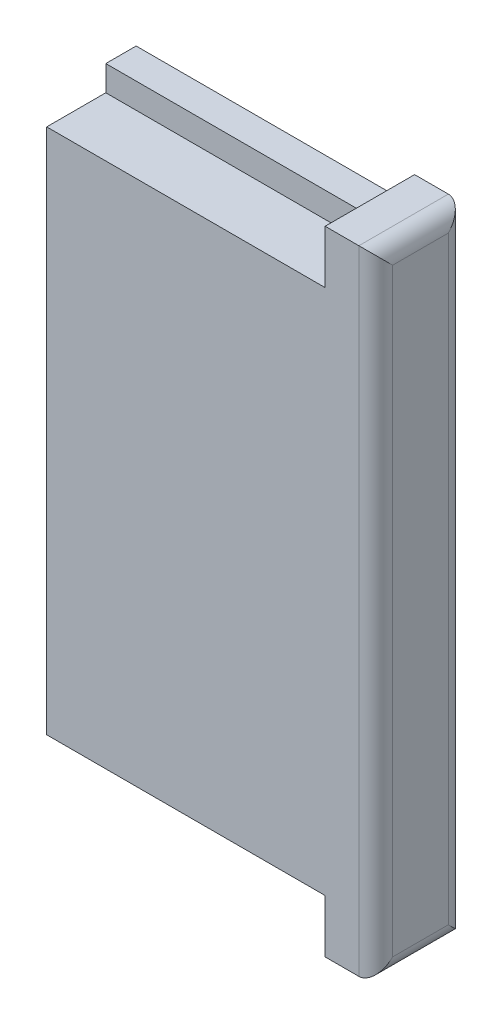
ISO-10303-21;
HEADER;
FILE_DESCRIPTION(('STEP AP214'),'2;1');
FILE_NAME('part.step','',(''),(''),'','','');
FILE_SCHEMA(('AUTOMOTIVE_DESIGN { 1 0 10303 214 1 1 1 1 }'));
ENDSEC;
DATA;
#1=APPLICATION_CONTEXT('core data for automotive mechanical design processes');
#2=APPLICATION_PROTOCOL_DEFINITION('international standard','automotive_design',2000,#1);
#3=PRODUCT_CONTEXT('',#1,'mechanical');
#4=PRODUCT('Part','Part','',(#3));
#5=PRODUCT_RELATED_PRODUCT_CATEGORY('part','',(#4));
#6=PRODUCT_DEFINITION_FORMATION('','',#4);
#7=PRODUCT_DEFINITION_CONTEXT('part definition',#1,'design');
#8=PRODUCT_DEFINITION('design','',#6,#7);
#9=PRODUCT_DEFINITION_SHAPE('','',#8);
#10=(LENGTH_UNIT() NAMED_UNIT(*) SI_UNIT(.MILLI.,.METRE.));
#11=(NAMED_UNIT(*) PLANE_ANGLE_UNIT() SI_UNIT($,.RADIAN.));
#12=(NAMED_UNIT(*) SI_UNIT($,.STERADIAN.) SOLID_ANGLE_UNIT());
#13=UNCERTAINTY_MEASURE_WITH_UNIT(LENGTH_MEASURE(1.E-05),#10,'distance_accuracy_value','');
#14=(GEOMETRIC_REPRESENTATION_CONTEXT(3) GLOBAL_UNCERTAINTY_ASSIGNED_CONTEXT((#13)) GLOBAL_UNIT_ASSIGNED_CONTEXT((#10,
#11,#12)) REPRESENTATION_CONTEXT('',''));
#15=CARTESIAN_POINT('',(0.,0.,0.));
#16=DIRECTION('',(0.,0.,1.));
#17=DIRECTION('',(1.,0.,0.));
#18=AXIS2_PLACEMENT_3D('',#15,#16,#17);
#19=CARTESIAN_POINT('',(0.,0.,1.8));
#20=DIRECTION('',(0.,0.,1.));
#21=DIRECTION('',(1.,0.,0.));
#22=AXIS2_PLACEMENT_3D('',#19,#20,#21);
#23=PLANE('',#22);
#24=DIRECTION('',(1.,0.,0.));
#25=VECTOR('',#24,1.);
#26=CARTESIAN_POINT('',(8.25,-15.6,1.8));
#27=LINE('',#26,#25);
#28=CARTESIAN_POINT('',(-8.25,-15.6,1.8));
#29=VERTEX_POINT('',#28);
#30=CARTESIAN_POINT('',(8.25,-15.6,1.8));
#31=VERTEX_POINT('',#30);
#32=EDGE_CURVE('E175',#29,#31,#27,.T.);
#33=ORIENTED_EDGE('',*,*,#32,.F.);
#34=DIRECTION('',(0.,-1.,0.));
#35=VECTOR('',#34,1.);
#36=CARTESIAN_POINT('',(-8.25,17.1,1.8));
#37=LINE('',#36,#35);
#38=CARTESIAN_POINT('',(-8.25,-17.1,1.8));
#39=VERTEX_POINT('',#38);
#40=EDGE_CURVE('E199',#29,#39,#37,.T.);
#41=ORIENTED_EDGE('',*,*,#40,.T.);
#42=DIRECTION('',(1.,0.,0.));
#43=VECTOR('',#42,1.);
#44=CARTESIAN_POINT('',(-8.25,-17.1,1.8));
#45=LINE('',#44,#43);
#46=CARTESIAN_POINT('',(8.25,-17.1,1.8));
#47=VERTEX_POINT('',#46);
#48=EDGE_CURVE('E198',#39,#47,#45,.T.);
#49=ORIENTED_EDGE('',*,*,#48,.T.);
#50=DIRECTION('',(0.,1.,0.));
#51=VECTOR('',#50,1.);
#52=CARTESIAN_POINT('',(8.25,17.1,1.8));
#53=LINE('',#52,#51);
#54=EDGE_CURVE('E202',#47,#31,#53,.T.);
#55=ORIENTED_EDGE('',*,*,#54,.T.);
#56=EDGE_LOOP('',(#33,#41,#49,#55));
#57=FACE_BOUND('',#56,.T.);
#58=ADVANCED_FACE('F33',(#57),#23,.T.);
#59=CARTESIAN_POINT('',(-8.25,17.1,1.8));
#60=DIRECTION('',(1.,0.,0.));
#61=DIRECTION('',(0.,1.,0.));
#62=AXIS2_PLACEMENT_3D('',#59,#60,#61);
#63=PLANE('',#62);
#64=DIRECTION('',(0.,-1.,0.));
#65=VECTOR('',#64,1.);
#66=CARTESIAN_POINT('',(-8.25,17.1,0.));
#67=LINE('',#66,#65);
#68=CARTESIAN_POINT('',(-8.25,17.1,0.));
#69=VERTEX_POINT('',#68);
#70=CARTESIAN_POINT('',(-8.25,-17.1,0.));
#71=VERTEX_POINT('',#70);
#72=EDGE_CURVE('E195',#69,#71,#67,.T.);
#73=ORIENTED_EDGE('',*,*,#72,.T.);
#74=DIRECTION('',(0.,0.,-1.));
#75=VECTOR('',#74,1.);
#76=CARTESIAN_POINT('',(-8.25,-17.1,1.8));
#77=LINE('',#76,#75);
#78=EDGE_CURVE('E219',#39,#71,#77,.T.);
#79=ORIENTED_EDGE('',*,*,#78,.F.);
#80=ORIENTED_EDGE('',*,*,#40,.F.);
#81=DIRECTION('',(0.,0.,-1.));
#82=VECTOR('',#81,1.);
#83=CARTESIAN_POINT('',(-8.25,-15.6,5.3));
#84=LINE('',#83,#82);
#85=CARTESIAN_POINT('',(-8.25,-15.6,5.3));
#86=VERTEX_POINT('',#85);
#87=EDGE_CURVE('E186',#86,#29,#84,.T.);
#88=ORIENTED_EDGE('',*,*,#87,.F.);
#89=DIRECTION('',(0.,-1.,0.));
#90=VECTOR('',#89,1.);
#91=CARTESIAN_POINT('',(-8.25,15.6,5.3));
#92=LINE('',#91,#90);
#93=CARTESIAN_POINT('',(-8.25,15.6,5.3));
#94=VERTEX_POINT('',#93);
#95=EDGE_CURVE('E174',#94,#86,#92,.T.);
#96=ORIENTED_EDGE('',*,*,#95,.F.);
#97=DIRECTION('',(0.,0.,-1.));
#98=VECTOR('',#97,1.);
#99=CARTESIAN_POINT('',(-8.25,15.6,5.3));
#100=LINE('',#99,#98);
#101=CARTESIAN_POINT('',(-8.25,15.6,1.8));
#102=VERTEX_POINT('',#101);
#103=EDGE_CURVE('E189',#94,#102,#100,.T.);
#104=ORIENTED_EDGE('',*,*,#103,.T.);
#105=CARTESIAN_POINT('',(-8.25,17.1,1.8));
#106=VERTEX_POINT('',#105);
#107=EDGE_CURVE('E196',#106,#102,#37,.T.);
#108=ORIENTED_EDGE('',*,*,#107,.F.);
#109=DIRECTION('',(0.,0.,-1.));
#110=VECTOR('',#109,1.);
#111=CARTESIAN_POINT('',(-8.25,17.1,1.8));
#112=LINE('',#111,#110);
#113=EDGE_CURVE('E206',#106,#69,#112,.T.);
#114=ORIENTED_EDGE('',*,*,#113,.T.);
#115=EDGE_LOOP('',(#73,#79,#80,#88,#96,#104,#108,#114));
#116=FACE_BOUND('',#115,.T.);
#117=ADVANCED_FACE('F276',(#116),#63,.F.);
#118=CARTESIAN_POINT('',(-8.25,-17.1,1.8));
#119=DIRECTION('',(0.,1.,0.));
#120=DIRECTION('',(0.,0.,1.));
#121=AXIS2_PLACEMENT_3D('',#118,#119,#120);
#122=PLANE('',#121);
#123=DIRECTION('',(1.,0.,0.));
#124=VECTOR('',#123,1.);
#125=CARTESIAN_POINT('',(-8.25,-17.1,0.));
#126=LINE('',#125,#124);
#127=CARTESIAN_POINT('',(8.25,-17.1,0.));
#128=VERTEX_POINT('',#127);
#129=EDGE_CURVE('E209',#71,#128,#126,.T.);
#130=ORIENTED_EDGE('',*,*,#129,.T.);
#131=DIRECTION('',(0.,0.,-1.));
#132=VECTOR('',#131,1.);
#133=CARTESIAN_POINT('',(8.25,-17.1,1.8));
#134=LINE('',#133,#132);
#135=EDGE_CURVE('E216',#47,#128,#134,.T.);
#136=ORIENTED_EDGE('',*,*,#135,.F.);
#137=ORIENTED_EDGE('',*,*,#48,.F.);
#138=ORIENTED_EDGE('',*,*,#78,.T.);
#139=EDGE_LOOP('',(#130,#136,#137,#138));
#140=FACE_BOUND('',#139,.T.);
#141=ADVANCED_FACE('F283',(#140),#122,.F.);
#142=CARTESIAN_POINT('',(-8.25,17.1,1.8));
#143=DIRECTION('',(0.,-1.,0.));
#144=DIRECTION('',(0.,0.,-1.));
#145=AXIS2_PLACEMENT_3D('',#142,#143,#144);
#146=PLANE('',#145);
#147=DIRECTION('',(-1.,0.,0.));
#148=VECTOR('',#147,1.);
#149=CARTESIAN_POINT('',(-8.25,17.1,0.));
#150=LINE('',#149,#148);
#151=CARTESIAN_POINT('',(8.25,17.1,0.));
#152=VERTEX_POINT('',#151);
#153=EDGE_CURVE('E149',#152,#69,#150,.T.);
#154=ORIENTED_EDGE('',*,*,#153,.T.);
#155=ORIENTED_EDGE('',*,*,#113,.F.);
#156=DIRECTION('',(-1.,0.,0.));
#157=VECTOR('',#156,1.);
#158=CARTESIAN_POINT('',(-8.25,17.1,1.8));
#159=LINE('',#158,#157);
#160=CARTESIAN_POINT('',(8.25,17.1,1.8));
#161=VERTEX_POINT('',#160);
#162=EDGE_CURVE('E204',#161,#106,#159,.T.);
#163=ORIENTED_EDGE('',*,*,#162,.F.);
#164=DIRECTION('',(0.,0.,-1.));
#165=VECTOR('',#164,1.);
#166=CARTESIAN_POINT('',(8.25,17.1,1.8));
#167=LINE('',#166,#165);
#168=EDGE_CURVE('E214',#161,#152,#167,.T.);
#169=ORIENTED_EDGE('',*,*,#168,.T.);
#170=EDGE_LOOP('',(#154,#155,#163,#169));
#171=FACE_BOUND('',#170,.T.);
#172=ADVANCED_FACE('F289',(#171),#146,.F.);
#173=DIRECTION('',(-1.,0.,0.));
#174=VECTOR('',#173,1.);
#175=CARTESIAN_POINT('',(8.25,15.6,1.8));
#176=LINE('',#175,#174);
#177=CARTESIAN_POINT('',(8.25,15.6,1.8));
#178=VERTEX_POINT('',#177);
#179=EDGE_CURVE('E141',#178,#102,#176,.T.);
#180=ORIENTED_EDGE('',*,*,#179,.F.);
#181=EDGE_CURVE('E201',#178,#161,#53,.T.);
#182=ORIENTED_EDGE('',*,*,#181,.T.);
#183=ORIENTED_EDGE('',*,*,#162,.T.);
#184=ORIENTED_EDGE('',*,*,#107,.T.);
#185=EDGE_LOOP('',(#180,#182,#183,#184));
#186=FACE_BOUND('',#185,.T.);
#187=ADVANCED_FACE('F279',(#186),#23,.T.);
#188=CARTESIAN_POINT('',(0.,0.,0.));
#189=DIRECTION('',(0.,0.,1.));
#190=DIRECTION('',(1.,0.,0.));
#191=AXIS2_PLACEMENT_3D('',#188,#189,#190);
#192=PLANE('',#191);
#193=DIRECTION('',(-1.,0.,0.));
#194=VECTOR('',#193,1.);
#195=CARTESIAN_POINT('',(11.25,18.75,0.));
#196=LINE('',#195,#194);
#197=CARTESIAN_POINT('',(10.25,18.75,0.));
#198=VERTEX_POINT('',#197);
#199=CARTESIAN_POINT('',(8.24999999999999,18.75,0.));
#200=VERTEX_POINT('',#199);
#201=EDGE_CURVE('E133',#198,#200,#196,.T.);
#202=ORIENTED_EDGE('',*,*,#201,.F.);
#203=DIRECTION('',(0.,1.,0.));
#204=VECTOR('',#203,1.);
#205=CARTESIAN_POINT('',(10.25,0.,0.));
#206=LINE('',#205,#204);
#207=CARTESIAN_POINT('',(10.25,-18.75,0.));
#208=VERTEX_POINT('',#207);
#209=EDGE_CURVE('E11',#198,#208,#206,.F.);
#210=ORIENTED_EDGE('',*,*,#209,.T.);
#211=DIRECTION('',(-1.,0.,0.));
#212=VECTOR('',#211,1.);
#213=CARTESIAN_POINT('',(11.25,-18.75,0.));
#214=LINE('',#213,#212);
#215=CARTESIAN_POINT('',(8.25,-18.75,0.));
#216=VERTEX_POINT('',#215);
#217=EDGE_CURVE('E167',#208,#216,#214,.T.);
#218=ORIENTED_EDGE('',*,*,#217,.T.);
#219=DIRECTION('',(0.,1.,0.));
#220=VECTOR('',#219,1.);
#221=CARTESIAN_POINT('',(8.24999999999999,18.75,0.));
#222=LINE('',#221,#220);
#223=EDGE_CURVE('E152',#216,#128,#222,.T.);
#224=ORIENTED_EDGE('',*,*,#223,.T.);
#225=ORIENTED_EDGE('',*,*,#129,.F.);
#226=ORIENTED_EDGE('',*,*,#72,.F.);
#227=ORIENTED_EDGE('',*,*,#153,.F.);
#228=EDGE_CURVE('E146',#152,#200,#222,.T.);
#229=ORIENTED_EDGE('',*,*,#228,.T.);
#230=EDGE_LOOP('',(#202,#210,#218,#224,#225,#226,#227,#229));
#231=FACE_BOUND('',#230,.T.);
#232=ADVANCED_FACE('F147',(#231),#192,.F.);
#233=CARTESIAN_POINT('',(8.25,15.6,5.3));
#234=DIRECTION('',(0.,-1.,0.));
#235=DIRECTION('',(0.,0.,-1.));
#236=AXIS2_PLACEMENT_3D('',#233,#234,#235);
#237=PLANE('',#236);
#238=ORIENTED_EDGE('',*,*,#179,.T.);
#239=ORIENTED_EDGE('',*,*,#103,.F.);
#240=DIRECTION('',(-1.,0.,0.));
#241=VECTOR('',#240,1.);
#242=CARTESIAN_POINT('',(8.25,15.6,5.3));
#243=LINE('',#242,#241);
#244=CARTESIAN_POINT('',(8.25,15.6,5.3));
#245=VERTEX_POINT('',#244);
#246=EDGE_CURVE('E172',#245,#94,#243,.T.);
#247=ORIENTED_EDGE('',*,*,#246,.F.);
#248=DIRECTION('',(0.,0.,-1.));
#249=VECTOR('',#248,1.);
#250=CARTESIAN_POINT('',(8.25,15.6,5.3));
#251=LINE('',#250,#249);
#252=EDGE_CURVE('E192',#245,#178,#251,.T.);
#253=ORIENTED_EDGE('',*,*,#252,.T.);
#254=EDGE_LOOP('',(#238,#239,#247,#253));
#255=FACE_BOUND('',#254,.T.);
#256=ADVANCED_FACE('F295',(#255),#237,.F.);
#257=CARTESIAN_POINT('',(8.25,-15.6,5.3));
#258=DIRECTION('',(0.,1.,0.));
#259=DIRECTION('',(-1.,0.,0.));
#260=AXIS2_PLACEMENT_3D('',#257,#258,#259);
#261=PLANE('',#260);
#262=ORIENTED_EDGE('',*,*,#32,.T.);
#263=DIRECTION('',(0.,0.,-1.));
#264=VECTOR('',#263,1.);
#265=CARTESIAN_POINT('',(8.25,-15.6,5.3));
#266=LINE('',#265,#264);
#267=CARTESIAN_POINT('',(8.25,-15.6,5.3));
#268=VERTEX_POINT('',#267);
#269=EDGE_CURVE('E179',#268,#31,#266,.T.);
#270=ORIENTED_EDGE('',*,*,#269,.F.);
#271=DIRECTION('',(1.,0.,0.));
#272=VECTOR('',#271,1.);
#273=CARTESIAN_POINT('',(8.25,-15.6,5.3));
#274=LINE('',#273,#272);
#275=EDGE_CURVE('E177',#86,#268,#274,.T.);
#276=ORIENTED_EDGE('',*,*,#275,.F.);
#277=ORIENTED_EDGE('',*,*,#87,.T.);
#278=EDGE_LOOP('',(#262,#270,#276,#277));
#279=FACE_BOUND('',#278,.T.);
#280=ADVANCED_FACE('F312',(#279),#261,.F.);
#281=CARTESIAN_POINT('',(0.,0.,5.3));
#282=DIRECTION('',(0.,0.,-1.));
#283=DIRECTION('',(-1.,0.,0.));
#284=AXIS2_PLACEMENT_3D('',#281,#282,#283);
#285=PLANE('',#284);
#286=DIRECTION('',(-1.,0.,0.));
#287=VECTOR('',#286,1.);
#288=CARTESIAN_POINT('',(11.25,-18.75,5.3));
#289=LINE('',#288,#287);
#290=CARTESIAN_POINT('',(10.25,-18.75,5.3));
#291=VERTEX_POINT('',#290);
#292=CARTESIAN_POINT('',(8.25,-18.75,5.3));
#293=VERTEX_POINT('',#292);
#294=EDGE_CURVE('E169',#291,#293,#289,.T.);
#295=ORIENTED_EDGE('',*,*,#294,.F.);
#296=DIRECTION('',(0.,-1.,0.));
#297=VECTOR('',#296,1.);
#298=CARTESIAN_POINT('',(10.25,0.,5.3));
#299=LINE('',#298,#297);
#300=CARTESIAN_POINT('',(10.25,18.75,5.30000000000001));
#301=VERTEX_POINT('',#300);
#302=EDGE_CURVE('E57',#291,#301,#299,.F.);
#303=ORIENTED_EDGE('',*,*,#302,.T.);
#304=DIRECTION('',(-1.,0.,0.));
#305=VECTOR('',#304,1.);
#306=CARTESIAN_POINT('',(11.25,18.75,5.30000000000001));
#307=LINE('',#306,#305);
#308=CARTESIAN_POINT('',(8.24999999999999,18.75,5.30000000000001));
#309=VERTEX_POINT('',#308);
#310=EDGE_CURVE('E142',#301,#309,#307,.T.);
#311=ORIENTED_EDGE('',*,*,#310,.T.);
#312=DIRECTION('',(0.,-1.,0.));
#313=VECTOR('',#312,1.);
#314=CARTESIAN_POINT('',(8.24999999999999,18.75,5.30000000000001));
#315=LINE('',#314,#313);
#316=EDGE_CURVE('E157',#309,#245,#315,.T.);
#317=ORIENTED_EDGE('',*,*,#316,.T.);
#318=ORIENTED_EDGE('',*,*,#246,.T.);
#319=ORIENTED_EDGE('',*,*,#95,.T.);
#320=ORIENTED_EDGE('',*,*,#275,.T.);
#321=EDGE_CURVE('E158',#268,#293,#315,.T.);
#322=ORIENTED_EDGE('',*,*,#321,.T.);
#323=EDGE_LOOP('',(#295,#303,#311,#317,#318,#319,#320,#322));
#324=FACE_BOUND('',#323,.T.);
#325=ADVANCED_FACE('F308',(#324),#285,.F.);
#326=CARTESIAN_POINT('',(8.25,0.,0.));
#327=DIRECTION('',(-1.,0.,0.));
#328=DIRECTION('',(0.,-1.,0.));
#329=AXIS2_PLACEMENT_3D('',#326,#327,#328);
#330=PLANE('',#329);
#331=ORIENTED_EDGE('',*,*,#168,.F.);
#332=ORIENTED_EDGE('',*,*,#181,.F.);
#333=ORIENTED_EDGE('',*,*,#252,.F.);
#334=ORIENTED_EDGE('',*,*,#316,.F.);
#335=DIRECTION('',(0.,0.,1.));
#336=VECTOR('',#335,1.);
#337=CARTESIAN_POINT('',(8.24999999999999,18.75,0.));
#338=LINE('',#337,#336);
#339=EDGE_CURVE('E137',#200,#309,#338,.T.);
#340=ORIENTED_EDGE('',*,*,#339,.F.);
#341=ORIENTED_EDGE('',*,*,#228,.F.);
#342=EDGE_LOOP('',(#331,#332,#333,#334,#340,#341));
#343=FACE_BOUND('',#342,.T.);
#344=ADVANCED_FACE('F154',(#343),#330,.T.);
#345=CARTESIAN_POINT('',(11.25,18.75,0.));
#346=DIRECTION('',(0.,-1.,0.));
#347=DIRECTION('',(1.,0.,0.));
#348=AXIS2_PLACEMENT_3D('',#345,#346,#347);
#349=PLANE('',#348);
#350=ORIENTED_EDGE('',*,*,#310,.F.);
#351=DIRECTION('',(0.,0.,1.));
#352=VECTOR('',#351,1.);
#353=CARTESIAN_POINT('',(10.25,18.75,0.));
#354=LINE('',#353,#352);
#355=EDGE_CURVE('E42',#301,#198,#354,.F.);
#356=ORIENTED_EDGE('',*,*,#355,.T.);
#357=ORIENTED_EDGE('',*,*,#201,.T.);
#358=ORIENTED_EDGE('',*,*,#339,.T.);
#359=EDGE_LOOP('',(#350,#356,#357,#358));
#360=FACE_BOUND('',#359,.T.);
#361=ADVANCED_FACE('F135',(#360),#349,.F.);
#362=CARTESIAN_POINT('',(11.25,-18.75,0.));
#363=DIRECTION('',(0.,1.,0.));
#364=DIRECTION('',(-1.,0.,0.));
#365=AXIS2_PLACEMENT_3D('',#362,#363,#364);
#366=PLANE('',#365);
#367=ORIENTED_EDGE('',*,*,#217,.F.);
#368=DIRECTION('',(0.,0.,-1.));
#369=VECTOR('',#368,1.);
#370=CARTESIAN_POINT('',(10.25,-18.75,0.));
#371=LINE('',#370,#369);
#372=EDGE_CURVE('E231',#208,#291,#371,.F.);
#373=ORIENTED_EDGE('',*,*,#372,.T.);
#374=ORIENTED_EDGE('',*,*,#294,.T.);
#375=DIRECTION('',(0.,0.,-1.));
#376=VECTOR('',#375,1.);
#377=CARTESIAN_POINT('',(8.25,-18.75,0.));
#378=LINE('',#377,#376);
#379=EDGE_CURVE('E164',#293,#216,#378,.T.);
#380=ORIENTED_EDGE('',*,*,#379,.T.);
#381=EDGE_LOOP('',(#367,#373,#374,#380));
#382=FACE_BOUND('',#381,.T.);
#383=ADVANCED_FACE('F257',(#382),#366,.F.);
#384=CARTESIAN_POINT('',(11.25,0.,0.));
#385=DIRECTION('',(-1.,0.,0.));
#386=DIRECTION('',(0.,-1.,0.));
#387=AXIS2_PLACEMENT_3D('',#384,#385,#386);
#388=PLANE('',#387);
#389=DIRECTION('',(0.,-1.,0.));
#390=VECTOR('',#389,1.);
#391=CARTESIAN_POINT('',(11.25,0.,4.3));
#392=LINE('',#391,#390);
#393=CARTESIAN_POINT('',(11.25,17.75,4.3));
#394=VERTEX_POINT('',#393);
#395=CARTESIAN_POINT('',(11.25,-17.75,4.3));
#396=VERTEX_POINT('',#395);
#397=EDGE_CURVE('E226',#394,#396,#392,.T.);
#398=ORIENTED_EDGE('',*,*,#397,.T.);
#399=DIRECTION('',(0.,0.,-1.));
#400=VECTOR('',#399,1.);
#401=CARTESIAN_POINT('',(11.25,-17.75,0.));
#402=LINE('',#401,#400);
#403=CARTESIAN_POINT('',(11.25,-17.75,1.));
#404=VERTEX_POINT('',#403);
#405=EDGE_CURVE('E228',#396,#404,#402,.T.);
#406=ORIENTED_EDGE('',*,*,#405,.T.);
#407=DIRECTION('',(0.,1.,0.));
#408=VECTOR('',#407,1.);
#409=CARTESIAN_POINT('',(11.25,0.,1.));
#410=LINE('',#409,#408);
#411=CARTESIAN_POINT('',(11.25,17.75,1.));
#412=VERTEX_POINT('',#411);
#413=EDGE_CURVE('E222',#404,#412,#410,.T.);
#414=ORIENTED_EDGE('',*,*,#413,.T.);
#415=DIRECTION('',(0.,0.,1.));
#416=VECTOR('',#415,1.);
#417=CARTESIAN_POINT('',(11.25,17.75,0.));
#418=LINE('',#417,#416);
#419=EDGE_CURVE('E224',#412,#394,#418,.T.);
#420=ORIENTED_EDGE('',*,*,#419,.T.);
#421=EDGE_LOOP('',(#398,#406,#414,#420));
#422=FACE_BOUND('',#421,.T.);
#423=ADVANCED_FACE('F264',(#422),#388,.F.);
#424=ORIENTED_EDGE('',*,*,#321,.F.);
#425=ORIENTED_EDGE('',*,*,#269,.T.);
#426=ORIENTED_EDGE('',*,*,#54,.F.);
#427=ORIENTED_EDGE('',*,*,#135,.T.);
#428=ORIENTED_EDGE('',*,*,#223,.F.);
#429=ORIENTED_EDGE('',*,*,#379,.F.);
#430=EDGE_LOOP('',(#424,#425,#426,#427,#428,#429));
#431=FACE_BOUND('',#430,.T.);
#432=ADVANCED_FACE('F266',(#431),#330,.T.);
#433=CARTESIAN_POINT('',(10.25,17.75,0.));
#434=DIRECTION('',(0.,0.,1.));
#435=DIRECTION('',(1.,0.,0.));
#436=AXIS2_PLACEMENT_3D('',#433,#434,#435);
#437=CYLINDRICAL_SURFACE('',#436,1.);
#438=CARTESIAN_POINT('',(10.25,17.75,1.));
#439=DIRECTION('',(0.,0.707106781186547,0.707106781186547));
#440=DIRECTION('',(0.,0.707106781186547,-0.707106781186547));
#441=AXIS2_PLACEMENT_3D('',#438,#439,#440);
#442=ELLIPSE('',#441,1.41421356237309,1.);
#443=EDGE_CURVE('E239',#198,#412,#442,.F.);
#444=ORIENTED_EDGE('',*,*,#443,.F.);
#445=ORIENTED_EDGE('',*,*,#355,.F.);
#446=CARTESIAN_POINT('',(10.25,17.75,4.3));
#447=DIRECTION('',(0.,-0.707106781186547,0.707106781186547));
#448=DIRECTION('',(0.,0.707106781186547,0.707106781186547));
#449=AXIS2_PLACEMENT_3D('',#446,#447,#448);
#450=ELLIPSE('',#449,1.41421356237309,1.);
#451=EDGE_CURVE('E37',#394,#301,#450,.T.);
#452=ORIENTED_EDGE('',*,*,#451,.F.);
#453=ORIENTED_EDGE('',*,*,#419,.F.);
#454=EDGE_LOOP('',(#444,#445,#452,#453));
#455=FACE_BOUND('',#454,.T.);
#456=ADVANCED_FACE('F35',(#455),#437,.T.);
#457=CARTESIAN_POINT('',(10.25,0.,4.3));
#458=DIRECTION('',(0.,-1.,0.));
#459=DIRECTION('',(1.,0.,0.));
#460=AXIS2_PLACEMENT_3D('',#457,#458,#459);
#461=CYLINDRICAL_SURFACE('',#460,1.);
#462=ORIENTED_EDGE('',*,*,#451,.T.);
#463=ORIENTED_EDGE('',*,*,#302,.F.);
#464=CARTESIAN_POINT('',(10.25,-17.75,4.3));
#465=DIRECTION('',(0.,-0.707106781186547,-0.707106781186547));
#466=DIRECTION('',(0.,-0.707106781186547,0.707106781186547));
#467=AXIS2_PLACEMENT_3D('',#464,#465,#466);
#468=ELLIPSE('',#467,1.41421356237309,1.);
#469=EDGE_CURVE('E238',#396,#291,#468,.T.);
#470=ORIENTED_EDGE('',*,*,#469,.F.);
#471=ORIENTED_EDGE('',*,*,#397,.F.);
#472=EDGE_LOOP('',(#462,#463,#470,#471));
#473=FACE_BOUND('',#472,.T.);
#474=ADVANCED_FACE('F248',(#473),#461,.T.);
#475=CARTESIAN_POINT('',(10.25,0.,1.));
#476=DIRECTION('',(0.,1.,0.));
#477=DIRECTION('',(-1.,0.,0.));
#478=AXIS2_PLACEMENT_3D('',#475,#476,#477);
#479=CYLINDRICAL_SURFACE('',#478,1.);
#480=ORIENTED_EDGE('',*,*,#443,.T.);
#481=ORIENTED_EDGE('',*,*,#413,.F.);
#482=CARTESIAN_POINT('',(10.25,-17.75,1.));
#483=DIRECTION('',(0.,0.707106781186547,-0.707106781186547));
#484=DIRECTION('',(0.,0.707106781186547,0.707106781186547));
#485=AXIS2_PLACEMENT_3D('',#482,#483,#484);
#486=ELLIPSE('',#485,1.41421356237309,1.);
#487=EDGE_CURVE('E236',#208,#404,#486,.F.);
#488=ORIENTED_EDGE('',*,*,#487,.F.);
#489=ORIENTED_EDGE('',*,*,#209,.F.);
#490=EDGE_LOOP('',(#480,#481,#488,#489));
#491=FACE_BOUND('',#490,.T.);
#492=ADVANCED_FACE('F253',(#491),#479,.T.);
#493=CARTESIAN_POINT('',(10.25,-17.75,0.));
#494=DIRECTION('',(0.,0.,-1.));
#495=DIRECTION('',(-1.,0.,0.));
#496=AXIS2_PLACEMENT_3D('',#493,#494,#495);
#497=CYLINDRICAL_SURFACE('',#496,1.);
#498=ORIENTED_EDGE('',*,*,#469,.T.);
#499=ORIENTED_EDGE('',*,*,#372,.F.);
#500=ORIENTED_EDGE('',*,*,#487,.T.);
#501=ORIENTED_EDGE('',*,*,#405,.F.);
#502=EDGE_LOOP('',(#498,#499,#500,#501));
#503=FACE_BOUND('',#502,.T.);
#504=ADVANCED_FACE('F261',(#503),#497,.T.);
#505=CLOSED_SHELL('',(#58,#117,#141,#172,#187,#232,#256,#280,#325,#344,#361,#383,#423,#432,#456,
#474,#492,#504));
#506=MANIFOLD_SOLID_BREP('B2',#505);
#507=ADVANCED_BREP_SHAPE_REPRESENTATION('',(#18,#506),#14);
#508=SHAPE_DEFINITION_REPRESENTATION(#9,#507);
ENDSEC;
END-ISO-10303-21;
